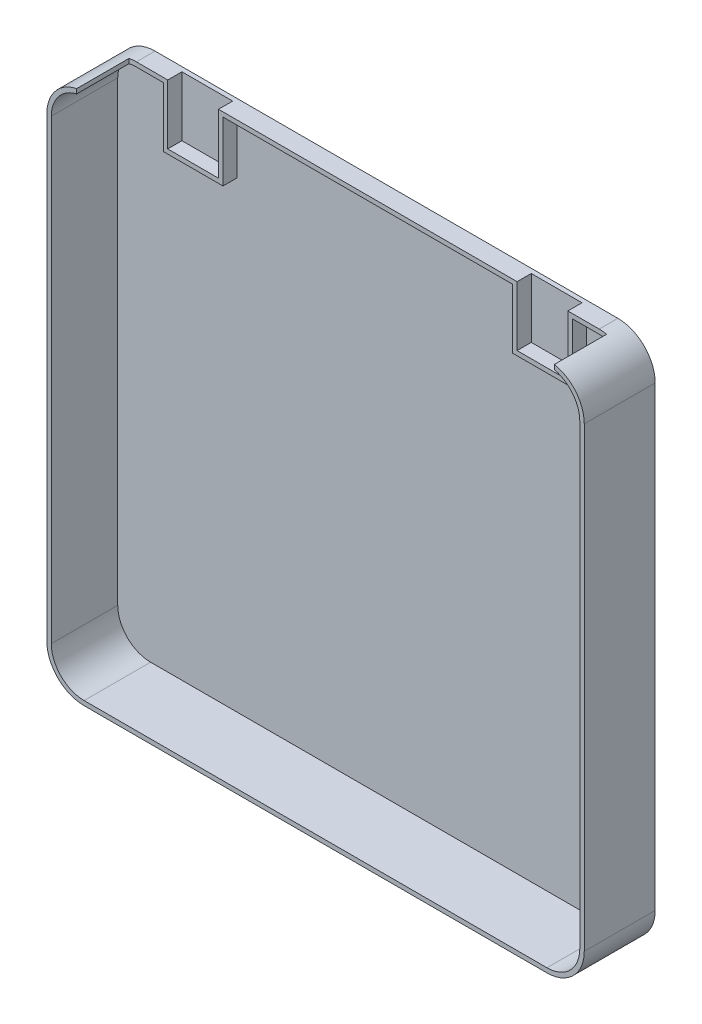
ISO-10303-21;
HEADER;
FILE_DESCRIPTION(('STEP AP214'),'2;1');
FILE_NAME('part.step','',(''),(''),'','','');
FILE_SCHEMA(('AUTOMOTIVE_DESIGN { 1 0 10303 214 1 1 1 1 }'));
ENDSEC;
DATA;
#1=APPLICATION_CONTEXT('core data for automotive mechanical design processes');
#2=APPLICATION_PROTOCOL_DEFINITION('international standard','automotive_design',2000,#1);
#3=PRODUCT_CONTEXT('',#1,'mechanical');
#4=PRODUCT('Part','Part','',(#3));
#5=PRODUCT_RELATED_PRODUCT_CATEGORY('part','',(#4));
#6=PRODUCT_DEFINITION_FORMATION('','',#4);
#7=PRODUCT_DEFINITION_CONTEXT('part definition',#1,'design');
#8=PRODUCT_DEFINITION('design','',#6,#7);
#9=PRODUCT_DEFINITION_SHAPE('','',#8);
#10=(LENGTH_UNIT() NAMED_UNIT(*) SI_UNIT(.MILLI.,.METRE.));
#11=(NAMED_UNIT(*) PLANE_ANGLE_UNIT() SI_UNIT($,.RADIAN.));
#12=(NAMED_UNIT(*) SI_UNIT($,.STERADIAN.) SOLID_ANGLE_UNIT());
#13=UNCERTAINTY_MEASURE_WITH_UNIT(LENGTH_MEASURE(1.E-05),#10,'distance_accuracy_value','');
#14=(GEOMETRIC_REPRESENTATION_CONTEXT(3) GLOBAL_UNCERTAINTY_ASSIGNED_CONTEXT((#13)) GLOBAL_UNIT_ASSIGNED_CONTEXT((#10,
#11,#12)) REPRESENTATION_CONTEXT('',''));
#15=CARTESIAN_POINT('',(0.,0.,0.));
#16=DIRECTION('',(0.,0.,1.));
#17=DIRECTION('',(1.,0.,0.));
#18=AXIS2_PLACEMENT_3D('',#15,#16,#17);
#19=CARTESIAN_POINT('',(335.,353.,3.));
#20=DIRECTION('',(0.,1.,0.));
#21=DIRECTION('',(0.,0.,1.));
#22=AXIS2_PLACEMENT_3D('',#19,#20,#21);
#23=PLANE('',#22);
#24=DIRECTION('',(0.,0.,-1.));
#25=VECTOR('',#24,1.);
#26=CARTESIAN_POINT('',(277.,353.,12.5));
#27=LINE('',#26,#25);
#28=CARTESIAN_POINT('',(277.,353.,12.5));
#29=VERTEX_POINT('',#28);
#30=CARTESIAN_POINT('',(277.,353.,3.));
#31=VERTEX_POINT('',#30);
#32=EDGE_CURVE('E444',#29,#31,#27,.T.);
#33=ORIENTED_EDGE('',*,*,#32,.F.);
#34=DIRECTION('',(1.,0.,0.));
#35=VECTOR('',#34,1.);
#36=CARTESIAN_POINT('',(335.,353.,12.5));
#37=LINE('',#36,#35);
#38=CARTESIAN_POINT('',(83.,353.,12.5));
#39=VERTEX_POINT('',#38);
#40=EDGE_CURVE('E512',#39,#29,#37,.T.);
#41=ORIENTED_EDGE('',*,*,#40,.F.);
#42=DIRECTION('',(0.,0.,-1.));
#43=VECTOR('',#42,1.);
#44=CARTESIAN_POINT('',(83.,353.,12.5));
#45=LINE('',#44,#43);
#46=CARTESIAN_POINT('',(83.,353.,3.));
#47=VERTEX_POINT('',#46);
#48=EDGE_CURVE('E353',#39,#47,#45,.T.);
#49=ORIENTED_EDGE('',*,*,#48,.T.);
#50=DIRECTION('',(-1.,0.,0.));
#51=VECTOR('',#50,1.);
#52=CARTESIAN_POINT('',(335.,353.,3.));
#53=LINE('',#52,#51);
#54=EDGE_CURVE('E560',#31,#47,#53,.T.);
#55=ORIENTED_EDGE('',*,*,#54,.F.);
#56=EDGE_LOOP('',(#33,#41,#49,#55));
#57=FACE_BOUND('',#56,.T.);
#58=ADVANCED_FACE('F86',(#57),#23,.F.);
#59=DIRECTION('',(0.,0.,-1.));
#60=VECTOR('',#59,1.);
#61=CARTESIAN_POINT('',(43.,353.,12.5));
#62=LINE('',#61,#60);
#63=CARTESIAN_POINT('',(43.,353.,12.5));
#64=VERTEX_POINT('',#63);
#65=CARTESIAN_POINT('',(43.,353.,3.));
#66=VERTEX_POINT('',#65);
#67=EDGE_CURVE('E358',#64,#66,#62,.T.);
#68=ORIENTED_EDGE('',*,*,#67,.F.);
#69=CARTESIAN_POINT('',(25.,353.,12.5));
#70=VERTEX_POINT('',#69);
#71=EDGE_CURVE('E515',#70,#64,#37,.T.);
#72=ORIENTED_EDGE('',*,*,#71,.F.);
#73=DIRECTION('',(0.,0.,1.));
#74=VECTOR('',#73,1.);
#75=CARTESIAN_POINT('',(25.,353.,3.));
#76=LINE('',#75,#74);
#77=CARTESIAN_POINT('',(25.,353.,3.));
#78=VERTEX_POINT('',#77);
#79=EDGE_CURVE('E579',#78,#70,#76,.T.);
#80=ORIENTED_EDGE('',*,*,#79,.F.);
#81=EDGE_CURVE('E556',#66,#78,#53,.T.);
#82=ORIENTED_EDGE('',*,*,#81,.F.);
#83=EDGE_LOOP('',(#68,#72,#80,#82));
#84=FACE_BOUND('',#83,.T.);
#85=ADVANCED_FACE('F483',(#84),#23,.F.);
#86=CARTESIAN_POINT('',(0.,356.,47.5));
#87=DIRECTION('',(0.,-1.,0.));
#88=DIRECTION('',(0.,0.,-1.));
#89=AXIS2_PLACEMENT_3D('',#86,#87,#88);
#90=PLANE('',#89);
#91=DIRECTION('',(1.,0.,0.));
#92=VECTOR('',#91,1.);
#93=CARTESIAN_POINT('',(20.,356.,12.5));
#94=LINE('',#93,#92);
#95=CARTESIAN_POINT('',(25.,356.,12.5));
#96=VERTEX_POINT('',#95);
#97=CARTESIAN_POINT('',(46.,356.,12.5));
#98=VERTEX_POINT('',#97);
#99=EDGE_CURVE('E322',#96,#98,#94,.T.);
#100=ORIENTED_EDGE('',*,*,#99,.T.);
#101=DIRECTION('',(0.,0.,1.));
#102=VECTOR('',#101,1.);
#103=CARTESIAN_POINT('',(46.,356.,12.5));
#104=LINE('',#103,#102);
#105=CARTESIAN_POINT('',(46.,356.,3.));
#106=VERTEX_POINT('',#105);
#107=EDGE_CURVE('E332',#106,#98,#104,.T.);
#108=ORIENTED_EDGE('',*,*,#107,.F.);
#109=DIRECTION('',(-1.,0.,0.));
#110=VECTOR('',#109,1.);
#111=CARTESIAN_POINT('',(46.,356.,3.));
#112=LINE('',#111,#110);
#113=CARTESIAN_POINT('',(80.,356.,3.));
#114=VERTEX_POINT('',#113);
#115=EDGE_CURVE('E457',#114,#106,#112,.T.);
#116=ORIENTED_EDGE('',*,*,#115,.F.);
#117=DIRECTION('',(0.,0.,-1.));
#118=VECTOR('',#117,1.);
#119=CARTESIAN_POINT('',(80.,356.,12.5));
#120=LINE('',#119,#118);
#121=CARTESIAN_POINT('',(80.,356.,12.5));
#122=VERTEX_POINT('',#121);
#123=EDGE_CURVE('E338',#122,#114,#120,.T.);
#124=ORIENTED_EDGE('',*,*,#123,.F.);
#125=CARTESIAN_POINT('',(280.,356.,12.5));
#126=VERTEX_POINT('',#125);
#127=EDGE_CURVE('E346',#122,#126,#94,.T.);
#128=ORIENTED_EDGE('',*,*,#127,.T.);
#129=DIRECTION('',(0.,0.,-1.));
#130=VECTOR('',#129,1.);
#131=CARTESIAN_POINT('',(280.,356.,12.5));
#132=LINE('',#131,#130);
#133=CARTESIAN_POINT('',(280.,356.,3.));
#134=VERTEX_POINT('',#133);
#135=EDGE_CURVE('E445',#126,#134,#132,.T.);
#136=ORIENTED_EDGE('',*,*,#135,.T.);
#137=DIRECTION('',(1.,0.,0.));
#138=VECTOR('',#137,1.);
#139=CARTESIAN_POINT('',(280.,356.,3.));
#140=LINE('',#139,#138);
#141=CARTESIAN_POINT('',(314.,356.,3.));
#142=VERTEX_POINT('',#141);
#143=EDGE_CURVE('E454',#134,#142,#140,.T.);
#144=ORIENTED_EDGE('',*,*,#143,.T.);
#145=DIRECTION('',(0.,0.,-1.));
#146=VECTOR('',#145,1.);
#147=CARTESIAN_POINT('',(314.,356.,12.5));
#148=LINE('',#147,#146);
#149=CARTESIAN_POINT('',(314.,356.,12.5));
#150=VERTEX_POINT('',#149);
#151=EDGE_CURVE('E452',#150,#142,#148,.T.);
#152=ORIENTED_EDGE('',*,*,#151,.F.);
#153=CARTESIAN_POINT('',(335.,356.,12.5));
#154=VERTEX_POINT('',#153);
#155=EDGE_CURVE('E348',#150,#154,#94,.T.);
#156=ORIENTED_EDGE('',*,*,#155,.T.);
#157=DIRECTION('',(0.,0.,-1.));
#158=VECTOR('',#157,1.);
#159=CARTESIAN_POINT('',(335.,356.,47.5));
#160=LINE('',#159,#158);
#161=CARTESIAN_POINT('',(335.,356.,0.));
#162=VERTEX_POINT('',#161);
#163=EDGE_CURVE('E648',#154,#162,#160,.T.);
#164=ORIENTED_EDGE('',*,*,#163,.T.);
#165=DIRECTION('',(-1.,0.,0.));
#166=VECTOR('',#165,1.);
#167=CARTESIAN_POINT('',(0.,356.,0.));
#168=LINE('',#167,#166);
#169=CARTESIAN_POINT('',(25.,356.,0.));
#170=VERTEX_POINT('',#169);
#171=EDGE_CURVE('E600',#162,#170,#168,.T.);
#172=ORIENTED_EDGE('',*,*,#171,.T.);
#173=DIRECTION('',(0.,0.,-1.));
#174=VECTOR('',#173,1.);
#175=CARTESIAN_POINT('',(25.,356.,47.5));
#176=LINE('',#175,#174);
#177=EDGE_CURVE('E344',#170,#96,#176,.F.);
#178=ORIENTED_EDGE('',*,*,#177,.T.);
#179=EDGE_LOOP('',(#100,#108,#116,#124,#128,#136,#144,#152,#156,#164,#172,#178));
#180=FACE_BOUND('',#179,.T.);
#181=ADVANCED_FACE('F341',(#180),#90,.F.);
#182=CARTESIAN_POINT('',(335.,331.,47.5));
#183=DIRECTION('',(0.,0.,-1.));
#184=DIRECTION('',(-1.,0.,0.));
#185=AXIS2_PLACEMENT_3D('',#182,#183,#184);
#186=CYLINDRICAL_SURFACE('',#185,25.);
#187=ORIENTED_EDGE('',*,*,#163,.F.);
#188=CARTESIAN_POINT('',(335.,331.,12.5));
#189=DIRECTION('',(0.,0.,1.));
#190=DIRECTION('',(1.,0.,0.));
#191=AXIS2_PLACEMENT_3D('',#188,#189,#190);
#192=CIRCLE('',#191,25.);
#193=CARTESIAN_POINT('',(340.,355.494897427832,12.5));
#194=VERTEX_POINT('',#193);
#195=EDGE_CURVE('E525',#154,#194,#192,.F.);
#196=ORIENTED_EDGE('',*,*,#195,.T.);
#197=DIRECTION('',(0.,0.,-1.));
#198=VECTOR('',#197,1.);
#199=CARTESIAN_POINT('',(340.,355.494897427832,47.5));
#200=LINE('',#199,#198);
#201=CARTESIAN_POINT('',(340.,355.494897427832,47.5));
#202=VERTEX_POINT('',#201);
#203=EDGE_CURVE('E513',#202,#194,#200,.T.);
#204=ORIENTED_EDGE('',*,*,#203,.F.);
#205=CARTESIAN_POINT('',(335.,331.,47.5));
#206=DIRECTION('',(0.,0.,-1.));
#207=DIRECTION('',(-1.,0.,0.));
#208=AXIS2_PLACEMENT_3D('',#205,#206,#207);
#209=CIRCLE('',#208,25.);
#210=CARTESIAN_POINT('',(360.,331.,47.5));
#211=VERTEX_POINT('',#210);
#212=EDGE_CURVE('E635',#211,#202,#209,.F.);
#213=ORIENTED_EDGE('',*,*,#212,.F.);
#214=DIRECTION('',(0.,0.,-1.));
#215=VECTOR('',#214,1.);
#216=CARTESIAN_POINT('',(360.,331.,47.5));
#217=LINE('',#216,#215);
#218=CARTESIAN_POINT('',(360.,331.,0.));
#219=VERTEX_POINT('',#218);
#220=EDGE_CURVE('E642',#219,#211,#217,.F.);
#221=ORIENTED_EDGE('',*,*,#220,.F.);
#222=CARTESIAN_POINT('',(335.,331.,0.));
#223=DIRECTION('',(0.,0.,-1.));
#224=DIRECTION('',(-1.,0.,0.));
#225=AXIS2_PLACEMENT_3D('',#222,#223,#224);
#226=CIRCLE('',#225,25.);
#227=EDGE_CURVE('E622',#162,#219,#226,.T.);
#228=ORIENTED_EDGE('',*,*,#227,.F.);
#229=EDGE_LOOP('',(#187,#196,#204,#213,#221,#228));
#230=FACE_BOUND('',#229,.T.);
#231=ADVANCED_FACE('F702',(#230),#186,.T.);
#232=CARTESIAN_POINT('',(25.,331.,47.5));
#233=DIRECTION('',(0.,0.,-1.));
#234=DIRECTION('',(-1.,0.,0.));
#235=AXIS2_PLACEMENT_3D('',#232,#233,#234);
#236=CYLINDRICAL_SURFACE('',#235,25.);
#237=DIRECTION('',(0.,0.,-1.));
#238=VECTOR('',#237,1.);
#239=CARTESIAN_POINT('',(20.,355.494897427832,47.5));
#240=LINE('',#239,#238);
#241=CARTESIAN_POINT('',(20.,355.494897427832,47.5));
#242=VERTEX_POINT('',#241);
#243=CARTESIAN_POINT('',(20.,355.494897427832,12.5));
#244=VERTEX_POINT('',#243);
#245=EDGE_CURVE('E530',#242,#244,#240,.T.);
#246=ORIENTED_EDGE('',*,*,#245,.T.);
#247=CARTESIAN_POINT('',(25.,331.,12.5));
#248=DIRECTION('',(0.,0.,1.));
#249=DIRECTION('',(1.,0.,0.));
#250=AXIS2_PLACEMENT_3D('',#247,#248,#249);
#251=CIRCLE('',#250,25.);
#252=EDGE_CURVE('E522',#244,#96,#251,.F.);
#253=ORIENTED_EDGE('',*,*,#252,.T.);
#254=ORIENTED_EDGE('',*,*,#177,.F.);
#255=CARTESIAN_POINT('',(25.,331.,0.));
#256=DIRECTION('',(0.,0.,-1.));
#257=DIRECTION('',(-1.,0.,0.));
#258=AXIS2_PLACEMENT_3D('',#255,#256,#257);
#259=CIRCLE('',#258,25.);
#260=CARTESIAN_POINT('',(0.,331.,0.));
#261=VERTEX_POINT('',#260);
#262=EDGE_CURVE('E620',#261,#170,#259,.T.);
#263=ORIENTED_EDGE('',*,*,#262,.F.);
#264=DIRECTION('',(0.,0.,-1.));
#265=VECTOR('',#264,1.);
#266=CARTESIAN_POINT('',(0.,331.,47.5));
#267=LINE('',#266,#265);
#268=CARTESIAN_POINT('',(0.,331.,47.5));
#269=VERTEX_POINT('',#268);
#270=EDGE_CURVE('E628',#269,#261,#267,.T.);
#271=ORIENTED_EDGE('',*,*,#270,.F.);
#272=CARTESIAN_POINT('',(25.,331.,47.5));
#273=DIRECTION('',(0.,0.,-1.));
#274=DIRECTION('',(-1.,0.,0.));
#275=AXIS2_PLACEMENT_3D('',#272,#273,#274);
#276=CIRCLE('',#275,25.);
#277=EDGE_CURVE('E633',#242,#269,#276,.F.);
#278=ORIENTED_EDGE('',*,*,#277,.F.);
#279=EDGE_LOOP('',(#246,#253,#254,#263,#271,#278));
#280=FACE_BOUND('',#279,.T.);
#281=ADVANCED_FACE('F88',(#280),#236,.T.);
#282=CARTESIAN_POINT('',(25.,331.,3.));
#283=DIRECTION('',(0.,0.,1.));
#284=DIRECTION('',(1.,0.,0.));
#285=AXIS2_PLACEMENT_3D('',#282,#283,#284);
#286=CYLINDRICAL_SURFACE('',#285,22.);
#287=CARTESIAN_POINT('',(25.,331.,12.5));
#288=DIRECTION('',(0.,0.,1.));
#289=DIRECTION('',(1.,0.,0.));
#290=AXIS2_PLACEMENT_3D('',#287,#288,#289);
#291=CIRCLE('',#290,22.);
#292=CARTESIAN_POINT('',(20.,352.424285285629,12.5));
#293=VERTEX_POINT('',#292);
#294=EDGE_CURVE('E520',#293,#70,#291,.F.);
#295=ORIENTED_EDGE('',*,*,#294,.F.);
#296=DIRECTION('',(0.,0.,1.));
#297=VECTOR('',#296,1.);
#298=CARTESIAN_POINT('',(20.,352.424285285629,3.));
#299=LINE('',#298,#297);
#300=CARTESIAN_POINT('',(20.,352.424285285629,47.5));
#301=VERTEX_POINT('',#300);
#302=EDGE_CURVE('E12',#301,#293,#299,.F.);
#303=ORIENTED_EDGE('',*,*,#302,.F.);
#304=CARTESIAN_POINT('',(25.,331.,47.5));
#305=DIRECTION('',(0.,0.,1.));
#306=DIRECTION('',(1.,0.,0.));
#307=AXIS2_PLACEMENT_3D('',#304,#305,#306);
#308=CIRCLE('',#307,22.);
#309=CARTESIAN_POINT('',(3.,331.,47.5));
#310=VERTEX_POINT('',#309);
#311=EDGE_CURVE('E533',#301,#310,#308,.T.);
#312=ORIENTED_EDGE('',*,*,#311,.T.);
#313=DIRECTION('',(0.,0.,1.));
#314=VECTOR('',#313,1.);
#315=CARTESIAN_POINT('',(3.,331.,3.));
#316=LINE('',#315,#314);
#317=CARTESIAN_POINT('',(3.,331.,3.));
#318=VERTEX_POINT('',#317);
#319=EDGE_CURVE('E559',#318,#310,#316,.T.);
#320=ORIENTED_EDGE('',*,*,#319,.F.);
#321=CARTESIAN_POINT('',(25.,331.,3.));
#322=DIRECTION('',(0.,0.,1.));
#323=DIRECTION('',(1.,0.,0.));
#324=AXIS2_PLACEMENT_3D('',#321,#322,#323);
#325=CIRCLE('',#324,22.);
#326=EDGE_CURVE('E534',#78,#318,#325,.T.);
#327=ORIENTED_EDGE('',*,*,#326,.F.);
#328=ORIENTED_EDGE('',*,*,#79,.T.);
#329=EDGE_LOOP('',(#295,#303,#312,#320,#327,#328));
#330=FACE_BOUND('',#329,.T.);
#331=ADVANCED_FACE('F494',(#330),#286,.F.);
#332=CARTESIAN_POINT('',(317.,353.,12.5));
#333=VERTEX_POINT('',#332);
#334=CARTESIAN_POINT('',(335.,353.,12.5));
#335=VERTEX_POINT('',#334);
#336=EDGE_CURVE('E506',#333,#335,#37,.T.);
#337=ORIENTED_EDGE('',*,*,#336,.F.);
#338=DIRECTION('',(0.,0.,-1.));
#339=VECTOR('',#338,1.);
#340=CARTESIAN_POINT('',(317.,353.,12.5));
#341=LINE('',#340,#339);
#342=CARTESIAN_POINT('',(317.,353.,3.));
#343=VERTEX_POINT('',#342);
#344=EDGE_CURVE('E441',#333,#343,#341,.T.);
#345=ORIENTED_EDGE('',*,*,#344,.T.);
#346=CARTESIAN_POINT('',(335.,353.,3.));
#347=VERTEX_POINT('',#346);
#348=EDGE_CURVE('E557',#347,#343,#53,.T.);
#349=ORIENTED_EDGE('',*,*,#348,.F.);
#350=DIRECTION('',(0.,0.,1.));
#351=VECTOR('',#350,1.);
#352=CARTESIAN_POINT('',(335.,353.,3.));
#353=LINE('',#352,#351);
#354=EDGE_CURVE('E509',#347,#335,#353,.T.);
#355=ORIENTED_EDGE('',*,*,#354,.T.);
#356=EDGE_LOOP('',(#337,#345,#349,#355));
#357=FACE_BOUND('',#356,.T.);
#358=ADVANCED_FACE('F485',(#357),#23,.F.);
#359=CARTESIAN_POINT('',(335.,331.,3.));
#360=DIRECTION('',(0.,0.,1.));
#361=DIRECTION('',(1.,0.,0.));
#362=AXIS2_PLACEMENT_3D('',#359,#360,#361);
#363=CYLINDRICAL_SURFACE('',#362,22.);
#364=CARTESIAN_POINT('',(335.,331.,12.5));
#365=DIRECTION('',(0.,0.,1.));
#366=DIRECTION('',(1.,0.,0.));
#367=AXIS2_PLACEMENT_3D('',#364,#365,#366);
#368=CIRCLE('',#367,22.);
#369=CARTESIAN_POINT('',(340.,352.424285285629,12.5));
#370=VERTEX_POINT('',#369);
#371=EDGE_CURVE('E94',#335,#370,#368,.F.);
#372=ORIENTED_EDGE('',*,*,#371,.F.);
#373=ORIENTED_EDGE('',*,*,#354,.F.);
#374=CARTESIAN_POINT('',(335.,331.,3.));
#375=DIRECTION('',(0.,0.,1.));
#376=DIRECTION('',(1.,0.,0.));
#377=AXIS2_PLACEMENT_3D('',#374,#375,#376);
#378=CIRCLE('',#377,22.);
#379=CARTESIAN_POINT('',(357.,331.,3.));
#380=VERTEX_POINT('',#379);
#381=EDGE_CURVE('E553',#380,#347,#378,.T.);
#382=ORIENTED_EDGE('',*,*,#381,.F.);
#383=DIRECTION('',(0.,0.,1.));
#384=VECTOR('',#383,1.);
#385=CARTESIAN_POINT('',(357.,331.,3.));
#386=LINE('',#385,#384);
#387=CARTESIAN_POINT('',(357.,331.,47.5));
#388=VERTEX_POINT('',#387);
#389=EDGE_CURVE('E584',#380,#388,#386,.T.);
#390=ORIENTED_EDGE('',*,*,#389,.T.);
#391=CARTESIAN_POINT('',(335.,331.,47.5));
#392=DIRECTION('',(0.,0.,1.));
#393=DIRECTION('',(1.,0.,0.));
#394=AXIS2_PLACEMENT_3D('',#391,#392,#393);
#395=CIRCLE('',#394,22.);
#396=CARTESIAN_POINT('',(340.,352.424285285629,47.5));
#397=VERTEX_POINT('',#396);
#398=EDGE_CURVE('E538',#388,#397,#395,.T.);
#399=ORIENTED_EDGE('',*,*,#398,.T.);
#400=DIRECTION('',(0.,0.,1.));
#401=VECTOR('',#400,1.);
#402=CARTESIAN_POINT('',(340.,352.424285285629,3.));
#403=LINE('',#402,#401);
#404=EDGE_CURVE('E650',#397,#370,#403,.F.);
#405=ORIENTED_EDGE('',*,*,#404,.T.);
#406=EDGE_LOOP('',(#372,#373,#382,#390,#399,#405));
#407=FACE_BOUND('',#406,.T.);
#408=ADVANCED_FACE('F493',(#407),#363,.F.);
#409=CARTESIAN_POINT('',(0.,0.,47.5));
#410=DIRECTION('',(1.,0.,0.));
#411=DIRECTION('',(0.,0.,-1.));
#412=AXIS2_PLACEMENT_3D('',#409,#410,#411);
#413=PLANE('',#412);
#414=DIRECTION('',(0.,-1.,0.));
#415=VECTOR('',#414,1.);
#416=CARTESIAN_POINT('',(0.,0.,0.));
#417=LINE('',#416,#415);
#418=CARTESIAN_POINT('',(0.,25.,0.));
#419=VERTEX_POINT('',#418);
#420=EDGE_CURVE('E582',#261,#419,#417,.T.);
#421=ORIENTED_EDGE('',*,*,#420,.T.);
#422=DIRECTION('',(0.,0.,-1.));
#423=VECTOR('',#422,1.);
#424=CARTESIAN_POINT('',(0.,25.,47.5));
#425=LINE('',#424,#423);
#426=CARTESIAN_POINT('',(0.,25.,47.5));
#427=VERTEX_POINT('',#426);
#428=EDGE_CURVE('E631',#419,#427,#425,.F.);
#429=ORIENTED_EDGE('',*,*,#428,.T.);
#430=DIRECTION('',(0.,-1.,0.));
#431=VECTOR('',#430,1.);
#432=CARTESIAN_POINT('',(0.,0.,47.5));
#433=LINE('',#432,#431);
#434=EDGE_CURVE('E596',#269,#427,#433,.T.);
#435=ORIENTED_EDGE('',*,*,#434,.F.);
#436=ORIENTED_EDGE('',*,*,#270,.T.);
#437=EDGE_LOOP('',(#421,#429,#435,#436));
#438=FACE_BOUND('',#437,.T.);
#439=ADVANCED_FACE('F500',(#438),#413,.F.);
#440=CARTESIAN_POINT('',(0.,0.,47.5));
#441=DIRECTION('',(0.,1.,0.));
#442=DIRECTION('',(0.,0.,1.));
#443=AXIS2_PLACEMENT_3D('',#440,#441,#442);
#444=PLANE('',#443);
#445=DIRECTION('',(1.,0.,0.));
#446=VECTOR('',#445,1.);
#447=CARTESIAN_POINT('',(0.,0.,47.5));
#448=LINE('',#447,#446);
#449=CARTESIAN_POINT('',(25.,0.,47.5));
#450=VERTEX_POINT('',#449);
#451=CARTESIAN_POINT('',(335.,0.,47.5));
#452=VERTEX_POINT('',#451);
#453=EDGE_CURVE('E599',#450,#452,#448,.T.);
#454=ORIENTED_EDGE('',*,*,#453,.F.);
#455=DIRECTION('',(0.,0.,-1.));
#456=VECTOR('',#455,1.);
#457=CARTESIAN_POINT('',(25.,0.,47.5));
#458=LINE('',#457,#456);
#459=CARTESIAN_POINT('',(25.,0.,0.));
#460=VERTEX_POINT('',#459);
#461=EDGE_CURVE('E617',#450,#460,#458,.T.);
#462=ORIENTED_EDGE('',*,*,#461,.T.);
#463=DIRECTION('',(1.,0.,0.));
#464=VECTOR('',#463,1.);
#465=CARTESIAN_POINT('',(0.,0.,0.));
#466=LINE('',#465,#464);
#467=CARTESIAN_POINT('',(335.,0.,0.));
#468=VERTEX_POINT('',#467);
#469=EDGE_CURVE('E609',#460,#468,#466,.T.);
#470=ORIENTED_EDGE('',*,*,#469,.T.);
#471=DIRECTION('',(0.,0.,-1.));
#472=VECTOR('',#471,1.);
#473=CARTESIAN_POINT('',(335.,0.,47.5));
#474=LINE('',#473,#472);
#475=EDGE_CURVE('E606',#468,#452,#474,.F.);
#476=ORIENTED_EDGE('',*,*,#475,.T.);
#477=EDGE_LOOP('',(#454,#462,#470,#476));
#478=FACE_BOUND('',#477,.T.);
#479=ADVANCED_FACE('F688',(#478),#444,.F.);
#480=CARTESIAN_POINT('',(360.,0.,47.5));
#481=DIRECTION('',(-1.,0.,0.));
#482=DIRECTION('',(0.,0.,1.));
#483=AXIS2_PLACEMENT_3D('',#480,#481,#482);
#484=PLANE('',#483);
#485=DIRECTION('',(0.,1.,0.));
#486=VECTOR('',#485,1.);
#487=CARTESIAN_POINT('',(360.,0.,47.5));
#488=LINE('',#487,#486);
#489=CARTESIAN_POINT('',(360.,25.,47.5));
#490=VERTEX_POINT('',#489);
#491=EDGE_CURVE('E603',#490,#211,#488,.T.);
#492=ORIENTED_EDGE('',*,*,#491,.F.);
#493=DIRECTION('',(0.,0.,-1.));
#494=VECTOR('',#493,1.);
#495=CARTESIAN_POINT('',(360.,25.,47.5));
#496=LINE('',#495,#494);
#497=CARTESIAN_POINT('',(360.,25.,0.));
#498=VERTEX_POINT('',#497);
#499=EDGE_CURVE('E644',#490,#498,#496,.T.);
#500=ORIENTED_EDGE('',*,*,#499,.T.);
#501=DIRECTION('',(0.,1.,0.));
#502=VECTOR('',#501,1.);
#503=CARTESIAN_POINT('',(360.,0.,0.));
#504=LINE('',#503,#502);
#505=EDGE_CURVE('E612',#498,#219,#504,.T.);
#506=ORIENTED_EDGE('',*,*,#505,.T.);
#507=ORIENTED_EDGE('',*,*,#220,.T.);
#508=EDGE_LOOP('',(#492,#500,#506,#507));
#509=FACE_BOUND('',#508,.T.);
#510=ADVANCED_FACE('F697',(#509),#484,.F.);
#511=CARTESIAN_POINT('',(0.,0.,47.5));
#512=DIRECTION('',(0.,0.,-1.));
#513=DIRECTION('',(-1.,0.,0.));
#514=AXIS2_PLACEMENT_3D('',#511,#512,#513);
#515=PLANE('',#514);
#516=ORIENTED_EDGE('',*,*,#212,.T.);
#517=DIRECTION('',(0.,1.,0.));
#518=VECTOR('',#517,1.);
#519=CARTESIAN_POINT('',(340.,346.,47.5));
#520=LINE('',#519,#518);
#521=EDGE_CURVE('E657',#397,#202,#520,.T.);
#522=ORIENTED_EDGE('',*,*,#521,.F.);
#523=ORIENTED_EDGE('',*,*,#398,.F.);
#524=DIRECTION('',(0.,1.,0.));
#525=VECTOR('',#524,1.);
#526=CARTESIAN_POINT('',(357.,25.,47.5));
#527=LINE('',#526,#525);
#528=CARTESIAN_POINT('',(357.,25.,47.5));
#529=VERTEX_POINT('',#528);
#530=EDGE_CURVE('E574',#529,#388,#527,.T.);
#531=ORIENTED_EDGE('',*,*,#530,.F.);
#532=CARTESIAN_POINT('',(335.,25.,47.5));
#533=DIRECTION('',(0.,0.,1.));
#534=DIRECTION('',(1.,0.,0.));
#535=AXIS2_PLACEMENT_3D('',#532,#533,#534);
#536=CIRCLE('',#535,22.);
#537=CARTESIAN_POINT('',(335.,3.,47.5));
#538=VERTEX_POINT('',#537);
#539=EDGE_CURVE('E571',#538,#529,#536,.T.);
#540=ORIENTED_EDGE('',*,*,#539,.F.);
#541=DIRECTION('',(1.,0.,0.));
#542=VECTOR('',#541,1.);
#543=CARTESIAN_POINT('',(25.,3.,47.5));
#544=LINE('',#543,#542);
#545=CARTESIAN_POINT('',(25.,3.,47.5));
#546=VERTEX_POINT('',#545);
#547=EDGE_CURVE('E568',#546,#538,#544,.T.);
#548=ORIENTED_EDGE('',*,*,#547,.F.);
#549=CARTESIAN_POINT('',(25.,25.,47.5));
#550=DIRECTION('',(0.,0.,1.));
#551=DIRECTION('',(1.,0.,0.));
#552=AXIS2_PLACEMENT_3D('',#549,#550,#551);
#553=CIRCLE('',#552,22.);
#554=CARTESIAN_POINT('',(3.,25.,47.5));
#555=VERTEX_POINT('',#554);
#556=EDGE_CURVE('E565',#555,#546,#553,.T.);
#557=ORIENTED_EDGE('',*,*,#556,.F.);
#558=DIRECTION('',(0.,-1.,0.));
#559=VECTOR('',#558,1.);
#560=CARTESIAN_POINT('',(3.,331.,47.5));
#561=LINE('',#560,#559);
#562=EDGE_CURVE('E562',#310,#555,#561,.T.);
#563=ORIENTED_EDGE('',*,*,#562,.F.);
#564=ORIENTED_EDGE('',*,*,#311,.F.);
#565=DIRECTION('',(0.,1.,0.));
#566=VECTOR('',#565,1.);
#567=CARTESIAN_POINT('',(20.,346.,47.5));
#568=LINE('',#567,#566);
#569=EDGE_CURVE('E350',#301,#242,#568,.T.);
#570=ORIENTED_EDGE('',*,*,#569,.T.);
#571=ORIENTED_EDGE('',*,*,#277,.T.);
#572=ORIENTED_EDGE('',*,*,#434,.T.);
#573=CARTESIAN_POINT('',(25.,25.,47.5));
#574=DIRECTION('',(0.,0.,-1.));
#575=DIRECTION('',(-1.,0.,0.));
#576=AXIS2_PLACEMENT_3D('',#573,#574,#575);
#577=CIRCLE('',#576,25.);
#578=EDGE_CURVE('E640',#427,#450,#577,.F.);
#579=ORIENTED_EDGE('',*,*,#578,.T.);
#580=ORIENTED_EDGE('',*,*,#453,.T.);
#581=CARTESIAN_POINT('',(335.,25.,47.5));
#582=DIRECTION('',(0.,0.,-1.));
#583=DIRECTION('',(-1.,0.,0.));
#584=AXIS2_PLACEMENT_3D('',#581,#582,#583);
#585=CIRCLE('',#584,25.);
#586=EDGE_CURVE('E638',#452,#490,#585,.F.);
#587=ORIENTED_EDGE('',*,*,#586,.T.);
#588=ORIENTED_EDGE('',*,*,#491,.T.);
#589=EDGE_LOOP('',(#516,#522,#523,#531,#540,#548,#557,#563,#564,#570,#571,#572,#579,#580,#587,#588));
#590=FACE_BOUND('',#589,.T.);
#591=ADVANCED_FACE('F660',(#590),#515,.F.);
#592=CARTESIAN_POINT('',(0.,0.,0.));
#593=DIRECTION('',(0.,0.,-1.));
#594=DIRECTION('',(-1.,0.,0.));
#595=AXIS2_PLACEMENT_3D('',#592,#593,#594);
#596=PLANE('',#595);
#597=ORIENTED_EDGE('',*,*,#469,.F.);
#598=CARTESIAN_POINT('',(25.,25.,0.));
#599=DIRECTION('',(0.,0.,-1.));
#600=DIRECTION('',(-1.,0.,0.));
#601=AXIS2_PLACEMENT_3D('',#598,#599,#600);
#602=CIRCLE('',#601,25.);
#603=EDGE_CURVE('E626',#460,#419,#602,.T.);
#604=ORIENTED_EDGE('',*,*,#603,.T.);
#605=ORIENTED_EDGE('',*,*,#420,.F.);
#606=ORIENTED_EDGE('',*,*,#262,.T.);
#607=ORIENTED_EDGE('',*,*,#171,.F.);
#608=ORIENTED_EDGE('',*,*,#227,.T.);
#609=ORIENTED_EDGE('',*,*,#505,.F.);
#610=CARTESIAN_POINT('',(335.,25.,0.));
#611=DIRECTION('',(0.,0.,-1.));
#612=DIRECTION('',(-1.,0.,0.));
#613=AXIS2_PLACEMENT_3D('',#610,#611,#612);
#614=CIRCLE('',#613,25.);
#615=EDGE_CURVE('E624',#498,#468,#614,.T.);
#616=ORIENTED_EDGE('',*,*,#615,.T.);
#617=EDGE_LOOP('',(#597,#604,#605,#606,#607,#608,#609,#616));
#618=FACE_BOUND('',#617,.T.);
#619=ADVANCED_FACE('F680',(#618),#596,.T.);
#620=CARTESIAN_POINT('',(25.,25.,47.5));
#621=DIRECTION('',(0.,0.,-1.));
#622=DIRECTION('',(-1.,0.,0.));
#623=AXIS2_PLACEMENT_3D('',#620,#621,#622);
#624=CYLINDRICAL_SURFACE('',#623,25.);
#625=ORIENTED_EDGE('',*,*,#578,.F.);
#626=ORIENTED_EDGE('',*,*,#428,.F.);
#627=ORIENTED_EDGE('',*,*,#603,.F.);
#628=ORIENTED_EDGE('',*,*,#461,.F.);
#629=EDGE_LOOP('',(#625,#626,#627,#628));
#630=FACE_BOUND('',#629,.T.);
#631=ADVANCED_FACE('F685',(#630),#624,.T.);
#632=CARTESIAN_POINT('',(335.,25.,47.5));
#633=DIRECTION('',(0.,0.,-1.));
#634=DIRECTION('',(-1.,0.,0.));
#635=AXIS2_PLACEMENT_3D('',#632,#633,#634);
#636=CYLINDRICAL_SURFACE('',#635,25.);
#637=ORIENTED_EDGE('',*,*,#586,.F.);
#638=ORIENTED_EDGE('',*,*,#475,.F.);
#639=ORIENTED_EDGE('',*,*,#615,.F.);
#640=ORIENTED_EDGE('',*,*,#499,.F.);
#641=EDGE_LOOP('',(#637,#638,#639,#640));
#642=FACE_BOUND('',#641,.T.);
#643=ADVANCED_FACE('F694',(#642),#636,.T.);
#644=CARTESIAN_POINT('',(357.,25.,3.));
#645=DIRECTION('',(1.,0.,0.));
#646=DIRECTION('',(0.,0.,-1.));
#647=AXIS2_PLACEMENT_3D('',#644,#645,#646);
#648=PLANE('',#647);
#649=ORIENTED_EDGE('',*,*,#530,.T.);
#650=ORIENTED_EDGE('',*,*,#389,.F.);
#651=DIRECTION('',(0.,1.,0.));
#652=VECTOR('',#651,1.);
#653=CARTESIAN_POINT('',(357.,25.,3.));
#654=LINE('',#653,#652);
#655=CARTESIAN_POINT('',(357.,25.,3.));
#656=VERTEX_POINT('',#655);
#657=EDGE_CURVE('E550',#656,#380,#654,.T.);
#658=ORIENTED_EDGE('',*,*,#657,.F.);
#659=DIRECTION('',(0.,0.,1.));
#660=VECTOR('',#659,1.);
#661=CARTESIAN_POINT('',(357.,25.,3.));
#662=LINE('',#661,#660);
#663=EDGE_CURVE('E586',#656,#529,#662,.T.);
#664=ORIENTED_EDGE('',*,*,#663,.T.);
#665=EDGE_LOOP('',(#649,#650,#658,#664));
#666=FACE_BOUND('',#665,.T.);
#667=ADVANCED_FACE('F760',(#666),#648,.F.);
#668=CARTESIAN_POINT('',(335.,25.,3.));
#669=DIRECTION('',(0.,0.,1.));
#670=DIRECTION('',(1.,0.,0.));
#671=AXIS2_PLACEMENT_3D('',#668,#669,#670);
#672=CYLINDRICAL_SURFACE('',#671,22.);
#673=ORIENTED_EDGE('',*,*,#539,.T.);
#674=ORIENTED_EDGE('',*,*,#663,.F.);
#675=CARTESIAN_POINT('',(335.,25.,3.));
#676=DIRECTION('',(0.,0.,1.));
#677=DIRECTION('',(1.,0.,0.));
#678=AXIS2_PLACEMENT_3D('',#675,#676,#677);
#679=CIRCLE('',#678,22.);
#680=CARTESIAN_POINT('',(335.,3.,3.));
#681=VERTEX_POINT('',#680);
#682=EDGE_CURVE('E547',#681,#656,#679,.T.);
#683=ORIENTED_EDGE('',*,*,#682,.F.);
#684=DIRECTION('',(0.,0.,1.));
#685=VECTOR('',#684,1.);
#686=CARTESIAN_POINT('',(335.,3.,3.));
#687=LINE('',#686,#685);
#688=EDGE_CURVE('E588',#681,#538,#687,.T.);
#689=ORIENTED_EDGE('',*,*,#688,.T.);
#690=EDGE_LOOP('',(#673,#674,#683,#689));
#691=FACE_BOUND('',#690,.T.);
#692=ADVANCED_FACE('F756',(#691),#672,.F.);
#693=CARTESIAN_POINT('',(25.,3.,3.));
#694=DIRECTION('',(0.,-1.,0.));
#695=DIRECTION('',(1.,0.,0.));
#696=AXIS2_PLACEMENT_3D('',#693,#694,#695);
#697=PLANE('',#696);
#698=ORIENTED_EDGE('',*,*,#547,.T.);
#699=ORIENTED_EDGE('',*,*,#688,.F.);
#700=DIRECTION('',(1.,0.,0.));
#701=VECTOR('',#700,1.);
#702=CARTESIAN_POINT('',(25.,3.,3.));
#703=LINE('',#702,#701);
#704=CARTESIAN_POINT('',(25.,3.,3.));
#705=VERTEX_POINT('',#704);
#706=EDGE_CURVE('E544',#705,#681,#703,.T.);
#707=ORIENTED_EDGE('',*,*,#706,.F.);
#708=DIRECTION('',(0.,0.,1.));
#709=VECTOR('',#708,1.);
#710=CARTESIAN_POINT('',(25.,3.,3.));
#711=LINE('',#710,#709);
#712=EDGE_CURVE('E590',#705,#546,#711,.T.);
#713=ORIENTED_EDGE('',*,*,#712,.T.);
#714=EDGE_LOOP('',(#698,#699,#707,#713));
#715=FACE_BOUND('',#714,.T.);
#716=ADVANCED_FACE('F752',(#715),#697,.F.);
#717=CARTESIAN_POINT('',(25.,25.,3.));
#718=DIRECTION('',(0.,0.,1.));
#719=DIRECTION('',(1.,0.,0.));
#720=AXIS2_PLACEMENT_3D('',#717,#718,#719);
#721=CYLINDRICAL_SURFACE('',#720,22.);
#722=ORIENTED_EDGE('',*,*,#556,.T.);
#723=ORIENTED_EDGE('',*,*,#712,.F.);
#724=CARTESIAN_POINT('',(25.,25.,3.));
#725=DIRECTION('',(0.,0.,1.));
#726=DIRECTION('',(1.,0.,0.));
#727=AXIS2_PLACEMENT_3D('',#724,#725,#726);
#728=CIRCLE('',#727,22.);
#729=CARTESIAN_POINT('',(3.,25.,3.));
#730=VERTEX_POINT('',#729);
#731=EDGE_CURVE('E541',#730,#705,#728,.T.);
#732=ORIENTED_EDGE('',*,*,#731,.F.);
#733=DIRECTION('',(0.,0.,1.));
#734=VECTOR('',#733,1.);
#735=CARTESIAN_POINT('',(3.,25.,3.));
#736=LINE('',#735,#734);
#737=EDGE_CURVE('E592',#730,#555,#736,.T.);
#738=ORIENTED_EDGE('',*,*,#737,.T.);
#739=EDGE_LOOP('',(#722,#723,#732,#738));
#740=FACE_BOUND('',#739,.T.);
#741=ADVANCED_FACE('F730',(#740),#721,.F.);
#742=CARTESIAN_POINT('',(3.,331.,3.));
#743=DIRECTION('',(-1.,0.,0.));
#744=DIRECTION('',(0.,0.,1.));
#745=AXIS2_PLACEMENT_3D('',#742,#743,#744);
#746=PLANE('',#745);
#747=ORIENTED_EDGE('',*,*,#562,.T.);
#748=ORIENTED_EDGE('',*,*,#737,.F.);
#749=DIRECTION('',(0.,-1.,0.));
#750=VECTOR('',#749,1.);
#751=CARTESIAN_POINT('',(3.,331.,3.));
#752=LINE('',#751,#750);
#753=EDGE_CURVE('E537',#318,#730,#752,.T.);
#754=ORIENTED_EDGE('',*,*,#753,.F.);
#755=ORIENTED_EDGE('',*,*,#319,.T.);
#756=EDGE_LOOP('',(#747,#748,#754,#755));
#757=FACE_BOUND('',#756,.T.);
#758=ADVANCED_FACE('F723',(#757),#746,.F.);
#759=CARTESIAN_POINT('',(25.,331.,3.));
#760=DIRECTION('',(0.,0.,1.));
#761=DIRECTION('',(1.,0.,0.));
#762=AXIS2_PLACEMENT_3D('',#759,#760,#761);
#763=PLANE('',#762);
#764=DIRECTION('',(0.,-1.,0.));
#765=VECTOR('',#764,1.);
#766=CARTESIAN_POINT('',(317.,353.,3.));
#767=LINE('',#766,#765);
#768=CARTESIAN_POINT('',(317.,313.,3.));
#769=VERTEX_POINT('',#768);
#770=EDGE_CURVE('E424',#343,#769,#767,.T.);
#771=ORIENTED_EDGE('',*,*,#770,.T.);
#772=DIRECTION('',(-1.,0.,0.));
#773=VECTOR('',#772,1.);
#774=CARTESIAN_POINT('',(317.,313.,3.));
#775=LINE('',#774,#773);
#776=CARTESIAN_POINT('',(277.,313.,3.));
#777=VERTEX_POINT('',#776);
#778=EDGE_CURVE('E436',#769,#777,#775,.T.);
#779=ORIENTED_EDGE('',*,*,#778,.T.);
#780=DIRECTION('',(0.,-1.,0.));
#781=VECTOR('',#780,1.);
#782=CARTESIAN_POINT('',(277.,353.,3.));
#783=LINE('',#782,#781);
#784=EDGE_CURVE('E427',#31,#777,#783,.T.);
#785=ORIENTED_EDGE('',*,*,#784,.F.);
#786=ORIENTED_EDGE('',*,*,#54,.T.);
#787=DIRECTION('',(0.,-1.,0.));
#788=VECTOR('',#787,1.);
#789=CARTESIAN_POINT('',(83.,0.,3.));
#790=LINE('',#789,#788);
#791=CARTESIAN_POINT('',(83.,313.,3.));
#792=VERTEX_POINT('',#791);
#793=EDGE_CURVE('E386',#47,#792,#790,.T.);
#794=ORIENTED_EDGE('',*,*,#793,.T.);
#795=DIRECTION('',(1.,0.,0.));
#796=VECTOR('',#795,1.);
#797=CARTESIAN_POINT('',(0.,313.,3.));
#798=LINE('',#797,#796);
#799=CARTESIAN_POINT('',(43.,313.,3.));
#800=VERTEX_POINT('',#799);
#801=EDGE_CURVE('E388',#800,#792,#798,.T.);
#802=ORIENTED_EDGE('',*,*,#801,.F.);
#803=DIRECTION('',(0.,-1.,0.));
#804=VECTOR('',#803,1.);
#805=CARTESIAN_POINT('',(43.0000000000002,0.,3.));
#806=LINE('',#805,#804);
#807=EDGE_CURVE('E367',#66,#800,#806,.T.);
#808=ORIENTED_EDGE('',*,*,#807,.F.);
#809=ORIENTED_EDGE('',*,*,#81,.T.);
#810=ORIENTED_EDGE('',*,*,#326,.T.);
#811=ORIENTED_EDGE('',*,*,#753,.T.);
#812=ORIENTED_EDGE('',*,*,#731,.T.);
#813=ORIENTED_EDGE('',*,*,#706,.T.);
#814=ORIENTED_EDGE('',*,*,#682,.T.);
#815=ORIENTED_EDGE('',*,*,#657,.T.);
#816=ORIENTED_EDGE('',*,*,#381,.T.);
#817=ORIENTED_EDGE('',*,*,#348,.T.);
#818=EDGE_LOOP('',(#771,#779,#785,#786,#794,#802,#808,#809,#810,#811,#812,#813,#814,#815,#816,#817));
#819=FACE_BOUND('',#818,.T.);
#820=ADVANCED_FACE('F478',(#819),#763,.T.);
#821=CARTESIAN_POINT('',(20.,346.,47.5));
#822=DIRECTION('',(1.,0.,0.));
#823=DIRECTION('',(0.,0.,-1.));
#824=AXIS2_PLACEMENT_3D('',#821,#822,#823);
#825=PLANE('',#824);
#826=ORIENTED_EDGE('',*,*,#569,.F.);
#827=ORIENTED_EDGE('',*,*,#302,.T.);
#828=DIRECTION('',(0.,1.,0.));
#829=VECTOR('',#828,1.);
#830=CARTESIAN_POINT('',(20.,346.,12.5));
#831=LINE('',#830,#829);
#832=EDGE_CURVE('E345',#293,#244,#831,.T.);
#833=ORIENTED_EDGE('',*,*,#832,.T.);
#834=ORIENTED_EDGE('',*,*,#245,.F.);
#835=EDGE_LOOP('',(#826,#827,#833,#834));
#836=FACE_BOUND('',#835,.T.);
#837=ADVANCED_FACE('F722',(#836),#825,.T.);
#838=CARTESIAN_POINT('',(20.,346.,12.5));
#839=DIRECTION('',(0.,0.,1.));
#840=DIRECTION('',(1.,0.,0.));
#841=AXIS2_PLACEMENT_3D('',#838,#839,#840);
#842=PLANE('',#841);
#843=DIRECTION('',(0.,-1.,0.));
#844=VECTOR('',#843,1.);
#845=CARTESIAN_POINT('',(46.0000000000002,0.,12.5));
#846=LINE('',#845,#844);
#847=CARTESIAN_POINT('',(46.,316.,12.5));
#848=VERTEX_POINT('',#847);
#849=EDGE_CURVE('E318',#98,#848,#846,.T.);
#850=ORIENTED_EDGE('',*,*,#849,.F.);
#851=ORIENTED_EDGE('',*,*,#99,.F.);
#852=ORIENTED_EDGE('',*,*,#252,.F.);
#853=ORIENTED_EDGE('',*,*,#832,.F.);
#854=ORIENTED_EDGE('',*,*,#294,.T.);
#855=ORIENTED_EDGE('',*,*,#71,.T.);
#856=DIRECTION('',(0.,-1.,0.));
#857=VECTOR('',#856,1.);
#858=CARTESIAN_POINT('',(43.0000000000002,0.,12.5));
#859=LINE('',#858,#857);
#860=CARTESIAN_POINT('',(43.,313.,12.5));
#861=VERTEX_POINT('',#860);
#862=EDGE_CURVE('E372',#64,#861,#859,.T.);
#863=ORIENTED_EDGE('',*,*,#862,.T.);
#864=DIRECTION('',(1.,0.,0.));
#865=VECTOR('',#864,1.);
#866=CARTESIAN_POINT('',(0.,313.,12.5));
#867=LINE('',#866,#865);
#868=CARTESIAN_POINT('',(83.,313.,12.5));
#869=VERTEX_POINT('',#868);
#870=EDGE_CURVE('E378',#861,#869,#867,.T.);
#871=ORIENTED_EDGE('',*,*,#870,.T.);
#872=DIRECTION('',(0.,-1.,0.));
#873=VECTOR('',#872,1.);
#874=CARTESIAN_POINT('',(83.,0.,12.5));
#875=LINE('',#874,#873);
#876=EDGE_CURVE('E382',#39,#869,#875,.T.);
#877=ORIENTED_EDGE('',*,*,#876,.F.);
#878=ORIENTED_EDGE('',*,*,#40,.T.);
#879=DIRECTION('',(0.,-1.,0.));
#880=VECTOR('',#879,1.);
#881=CARTESIAN_POINT('',(277.,353.,12.5));
#882=LINE('',#881,#880);
#883=CARTESIAN_POINT('',(277.,313.,12.5));
#884=VERTEX_POINT('',#883);
#885=EDGE_CURVE('E431',#29,#884,#882,.T.);
#886=ORIENTED_EDGE('',*,*,#885,.T.);
#887=DIRECTION('',(-1.,0.,0.));
#888=VECTOR('',#887,1.);
#889=CARTESIAN_POINT('',(317.,313.,12.5));
#890=LINE('',#889,#888);
#891=CARTESIAN_POINT('',(317.,313.,12.5));
#892=VERTEX_POINT('',#891);
#893=EDGE_CURVE('E428',#892,#884,#890,.T.);
#894=ORIENTED_EDGE('',*,*,#893,.F.);
#895=DIRECTION('',(0.,-1.,0.));
#896=VECTOR('',#895,1.);
#897=CARTESIAN_POINT('',(317.,353.,12.5));
#898=LINE('',#897,#896);
#899=EDGE_CURVE('E109',#333,#892,#898,.T.);
#900=ORIENTED_EDGE('',*,*,#899,.F.);
#901=ORIENTED_EDGE('',*,*,#336,.T.);
#902=ORIENTED_EDGE('',*,*,#371,.T.);
#903=DIRECTION('',(0.,1.,0.));
#904=VECTOR('',#903,1.);
#905=CARTESIAN_POINT('',(340.,346.,12.5));
#906=LINE('',#905,#904);
#907=EDGE_CURVE('E517',#370,#194,#906,.T.);
#908=ORIENTED_EDGE('',*,*,#907,.T.);
#909=ORIENTED_EDGE('',*,*,#195,.F.);
#910=ORIENTED_EDGE('',*,*,#155,.F.);
#911=DIRECTION('',(0.,-1.,0.));
#912=VECTOR('',#911,1.);
#913=CARTESIAN_POINT('',(314.,0.,12.5));
#914=LINE('',#913,#912);
#915=CARTESIAN_POINT('',(314.,316.,12.5));
#916=VERTEX_POINT('',#915);
#917=EDGE_CURVE('E407',#150,#916,#914,.T.);
#918=ORIENTED_EDGE('',*,*,#917,.T.);
#919=DIRECTION('',(-1.,0.,0.));
#920=VECTOR('',#919,1.);
#921=CARTESIAN_POINT('',(0.,316.,12.5));
#922=LINE('',#921,#920);
#923=CARTESIAN_POINT('',(280.,316.,12.5));
#924=VERTEX_POINT('',#923);
#925=EDGE_CURVE('E410',#916,#924,#922,.T.);
#926=ORIENTED_EDGE('',*,*,#925,.T.);
#927=DIRECTION('',(0.,-1.,0.));
#928=VECTOR('',#927,1.);
#929=CARTESIAN_POINT('',(280.,0.,12.5));
#930=LINE('',#929,#928);
#931=EDGE_CURVE('E413',#126,#924,#930,.T.);
#932=ORIENTED_EDGE('',*,*,#931,.F.);
#933=ORIENTED_EDGE('',*,*,#127,.F.);
#934=DIRECTION('',(0.,-1.,0.));
#935=VECTOR('',#934,1.);
#936=CARTESIAN_POINT('',(80.,0.,12.5));
#937=LINE('',#936,#935);
#938=CARTESIAN_POINT('',(80.,316.,12.5));
#939=VERTEX_POINT('',#938);
#940=EDGE_CURVE('E399',#122,#939,#937,.T.);
#941=ORIENTED_EDGE('',*,*,#940,.T.);
#942=DIRECTION('',(1.,0.,0.));
#943=VECTOR('',#942,1.);
#944=CARTESIAN_POINT('',(0.,316.,12.5));
#945=LINE('',#944,#943);
#946=EDGE_CURVE('E325',#848,#939,#945,.T.);
#947=ORIENTED_EDGE('',*,*,#946,.F.);
#948=EDGE_LOOP('',(#850,#851,#852,#853,#854,#855,#863,#871,#877,#878,#886,#894,#900,#901,#902,
#908,#909,#910,#918,#926,#932,#933,#941,#947));
#949=FACE_BOUND('',#948,.T.);
#950=ADVANCED_FACE('F320',(#949),#842,.T.);
#951=CARTESIAN_POINT('',(340.,346.,47.5));
#952=DIRECTION('',(1.,0.,0.));
#953=DIRECTION('',(0.,0.,-1.));
#954=AXIS2_PLACEMENT_3D('',#951,#952,#953);
#955=PLANE('',#954);
#956=ORIENTED_EDGE('',*,*,#203,.T.);
#957=ORIENTED_EDGE('',*,*,#907,.F.);
#958=ORIENTED_EDGE('',*,*,#404,.F.);
#959=ORIENTED_EDGE('',*,*,#521,.T.);
#960=EDGE_LOOP('',(#956,#957,#958,#959));
#961=FACE_BOUND('',#960,.T.);
#962=ADVANCED_FACE('F656',(#961),#955,.F.);
#963=CARTESIAN_POINT('',(83.,0.,12.5));
#964=DIRECTION('',(1.,0.,0.));
#965=DIRECTION('',(0.,0.,-1.));
#966=AXIS2_PLACEMENT_3D('',#963,#964,#965);
#967=PLANE('',#966);
#968=ORIENTED_EDGE('',*,*,#793,.F.);
#969=ORIENTED_EDGE('',*,*,#48,.F.);
#970=ORIENTED_EDGE('',*,*,#876,.T.);
#971=DIRECTION('',(0.,0.,-1.));
#972=VECTOR('',#971,1.);
#973=CARTESIAN_POINT('',(83.,313.,12.5));
#974=LINE('',#973,#972);
#975=EDGE_CURVE('E371',#869,#792,#974,.T.);
#976=ORIENTED_EDGE('',*,*,#975,.T.);
#977=EDGE_LOOP('',(#968,#969,#970,#976));
#978=FACE_BOUND('',#977,.T.);
#979=ADVANCED_FACE('F830',(#978),#967,.T.);
#980=CARTESIAN_POINT('',(43.0000000000002,0.,12.5));
#981=DIRECTION('',(1.,0.,0.));
#982=DIRECTION('',(0.,1.,0.));
#983=AXIS2_PLACEMENT_3D('',#980,#981,#982);
#984=PLANE('',#983);
#985=ORIENTED_EDGE('',*,*,#807,.T.);
#986=DIRECTION('',(0.,0.,-1.));
#987=VECTOR('',#986,1.);
#988=CARTESIAN_POINT('',(43.,313.,12.5));
#989=LINE('',#988,#987);
#990=EDGE_CURVE('E364',#861,#800,#989,.T.);
#991=ORIENTED_EDGE('',*,*,#990,.F.);
#992=ORIENTED_EDGE('',*,*,#862,.F.);
#993=ORIENTED_EDGE('',*,*,#67,.T.);
#994=EDGE_LOOP('',(#985,#991,#992,#993));
#995=FACE_BOUND('',#994,.T.);
#996=ADVANCED_FACE('F860',(#995),#984,.F.);
#997=CARTESIAN_POINT('',(0.,313.,12.5));
#998=DIRECTION('',(0.,1.,0.));
#999=DIRECTION('',(0.,0.,1.));
#1000=AXIS2_PLACEMENT_3D('',#997,#998,#999);
#1001=PLANE('',#1000);
#1002=ORIENTED_EDGE('',*,*,#801,.T.);
#1003=ORIENTED_EDGE('',*,*,#975,.F.);
#1004=ORIENTED_EDGE('',*,*,#870,.F.);
#1005=ORIENTED_EDGE('',*,*,#990,.T.);
#1006=EDGE_LOOP('',(#1002,#1003,#1004,#1005));
#1007=FACE_BOUND('',#1006,.T.);
#1008=ADVANCED_FACE('F869',(#1007),#1001,.F.);
#1009=CARTESIAN_POINT('',(80.,0.,12.5));
#1010=DIRECTION('',(1.,0.,0.));
#1011=DIRECTION('',(0.,0.,-1.));
#1012=AXIS2_PLACEMENT_3D('',#1009,#1010,#1011);
#1013=PLANE('',#1012);
#1014=DIRECTION('',(0.,0.,-1.));
#1015=VECTOR('',#1014,1.);
#1016=CARTESIAN_POINT('',(80.,316.,12.5));
#1017=LINE('',#1016,#1015);
#1018=CARTESIAN_POINT('',(80.,316.,3.));
#1019=VERTEX_POINT('',#1018);
#1020=EDGE_CURVE('E329',#939,#1019,#1017,.T.);
#1021=ORIENTED_EDGE('',*,*,#1020,.F.);
#1022=ORIENTED_EDGE('',*,*,#940,.F.);
#1023=ORIENTED_EDGE('',*,*,#123,.T.);
#1024=DIRECTION('',(0.,-1.,0.));
#1025=VECTOR('',#1024,1.);
#1026=CARTESIAN_POINT('',(80.,0.,3.));
#1027=LINE('',#1026,#1025);
#1028=EDGE_CURVE('E403',#114,#1019,#1027,.T.);
#1029=ORIENTED_EDGE('',*,*,#1028,.T.);
#1030=EDGE_LOOP('',(#1021,#1022,#1023,#1029));
#1031=FACE_BOUND('',#1030,.T.);
#1032=ADVANCED_FACE('F463',(#1031),#1013,.F.);
#1033=CARTESIAN_POINT('',(46.0000000000002,0.,12.5));
#1034=DIRECTION('',(1.,0.,0.));
#1035=DIRECTION('',(0.,1.,0.));
#1036=AXIS2_PLACEMENT_3D('',#1033,#1034,#1035);
#1037=PLANE('',#1036);
#1038=DIRECTION('',(0.,0.,-1.));
#1039=VECTOR('',#1038,1.);
#1040=CARTESIAN_POINT('',(46.,316.,12.5));
#1041=LINE('',#1040,#1039);
#1042=CARTESIAN_POINT('',(46.,316.,3.));
#1043=VERTEX_POINT('',#1042);
#1044=EDGE_CURVE('E389',#848,#1043,#1041,.T.);
#1045=ORIENTED_EDGE('',*,*,#1044,.T.);
#1046=DIRECTION('',(0.,-1.,0.));
#1047=VECTOR('',#1046,1.);
#1048=CARTESIAN_POINT('',(46.0000000000002,0.,3.));
#1049=LINE('',#1048,#1047);
#1050=EDGE_CURVE('E334',#106,#1043,#1049,.T.);
#1051=ORIENTED_EDGE('',*,*,#1050,.F.);
#1052=ORIENTED_EDGE('',*,*,#107,.T.);
#1053=ORIENTED_EDGE('',*,*,#849,.T.);
#1054=EDGE_LOOP('',(#1045,#1051,#1052,#1053));
#1055=FACE_BOUND('',#1054,.T.);
#1056=ADVANCED_FACE('F333',(#1055),#1037,.T.);
#1057=CARTESIAN_POINT('',(0.,316.,12.5));
#1058=DIRECTION('',(0.,1.,0.));
#1059=DIRECTION('',(0.,0.,1.));
#1060=AXIS2_PLACEMENT_3D('',#1057,#1058,#1059);
#1061=PLANE('',#1060);
#1062=DIRECTION('',(1.,0.,0.));
#1063=VECTOR('',#1062,1.);
#1064=CARTESIAN_POINT('',(0.,316.,3.));
#1065=LINE('',#1064,#1063);
#1066=EDGE_CURVE('E400',#1043,#1019,#1065,.T.);
#1067=ORIENTED_EDGE('',*,*,#1066,.F.);
#1068=ORIENTED_EDGE('',*,*,#1044,.F.);
#1069=ORIENTED_EDGE('',*,*,#946,.T.);
#1070=ORIENTED_EDGE('',*,*,#1020,.T.);
#1071=EDGE_LOOP('',(#1067,#1068,#1069,#1070));
#1072=FACE_BOUND('',#1071,.T.);
#1073=ADVANCED_FACE('F469',(#1072),#1061,.T.);
#1074=ORIENTED_EDGE('',*,*,#1066,.T.);
#1075=ORIENTED_EDGE('',*,*,#1028,.F.);
#1076=ORIENTED_EDGE('',*,*,#115,.T.);
#1077=ORIENTED_EDGE('',*,*,#1050,.T.);
#1078=EDGE_LOOP('',(#1074,#1075,#1076,#1077));
#1079=FACE_BOUND('',#1078,.T.);
#1080=ADVANCED_FACE('F466',(#1079),#763,.T.);
#1081=CARTESIAN_POINT('',(317.,353.,12.5));
#1082=DIRECTION('',(1.,0.,0.));
#1083=DIRECTION('',(0.,0.,-1.));
#1084=AXIS2_PLACEMENT_3D('',#1081,#1082,#1083);
#1085=PLANE('',#1084);
#1086=ORIENTED_EDGE('',*,*,#770,.F.);
#1087=ORIENTED_EDGE('',*,*,#344,.F.);
#1088=ORIENTED_EDGE('',*,*,#899,.T.);
#1089=DIRECTION('',(0.,0.,-1.));
#1090=VECTOR('',#1089,1.);
#1091=CARTESIAN_POINT('',(317.,313.,12.5));
#1092=LINE('',#1091,#1090);
#1093=EDGE_CURVE('E433',#892,#769,#1092,.T.);
#1094=ORIENTED_EDGE('',*,*,#1093,.T.);
#1095=EDGE_LOOP('',(#1086,#1087,#1088,#1094));
#1096=FACE_BOUND('',#1095,.T.);
#1097=ADVANCED_FACE('F476',(#1096),#1085,.T.);
#1098=CARTESIAN_POINT('',(277.,353.,12.5));
#1099=DIRECTION('',(1.,0.,0.));
#1100=DIRECTION('',(0.,0.,-1.));
#1101=AXIS2_PLACEMENT_3D('',#1098,#1099,#1100);
#1102=PLANE('',#1101);
#1103=ORIENTED_EDGE('',*,*,#784,.T.);
#1104=DIRECTION('',(0.,0.,-1.));
#1105=VECTOR('',#1104,1.);
#1106=CARTESIAN_POINT('',(277.,313.,12.5));
#1107=LINE('',#1106,#1105);
#1108=EDGE_CURVE('E447',#884,#777,#1107,.T.);
#1109=ORIENTED_EDGE('',*,*,#1108,.F.);
#1110=ORIENTED_EDGE('',*,*,#885,.F.);
#1111=ORIENTED_EDGE('',*,*,#32,.T.);
#1112=EDGE_LOOP('',(#1103,#1109,#1110,#1111));
#1113=FACE_BOUND('',#1112,.T.);
#1114=ADVANCED_FACE('F740',(#1113),#1102,.F.);
#1115=CARTESIAN_POINT('',(317.,313.,12.5));
#1116=DIRECTION('',(0.,-1.,0.));
#1117=DIRECTION('',(0.,0.,-1.));
#1118=AXIS2_PLACEMENT_3D('',#1115,#1116,#1117);
#1119=PLANE('',#1118);
#1120=ORIENTED_EDGE('',*,*,#778,.F.);
#1121=ORIENTED_EDGE('',*,*,#1093,.F.);
#1122=ORIENTED_EDGE('',*,*,#893,.T.);
#1123=ORIENTED_EDGE('',*,*,#1108,.T.);
#1124=EDGE_LOOP('',(#1120,#1121,#1122,#1123));
#1125=FACE_BOUND('',#1124,.T.);
#1126=ADVANCED_FACE('F737',(#1125),#1119,.T.);
#1127=CARTESIAN_POINT('',(314.,0.,12.5));
#1128=DIRECTION('',(1.,0.,0.));
#1129=DIRECTION('',(0.,0.,-1.));
#1130=AXIS2_PLACEMENT_3D('',#1127,#1128,#1129);
#1131=PLANE('',#1130);
#1132=DIRECTION('',(0.,-1.,0.));
#1133=VECTOR('',#1132,1.);
#1134=CARTESIAN_POINT('',(314.,0.,3.));
#1135=LINE('',#1134,#1133);
#1136=CARTESIAN_POINT('',(314.,316.,3.));
#1137=VERTEX_POINT('',#1136);
#1138=EDGE_CURVE('E101',#142,#1137,#1135,.T.);
#1139=ORIENTED_EDGE('',*,*,#1138,.T.);
#1140=DIRECTION('',(0.,0.,-1.));
#1141=VECTOR('',#1140,1.);
#1142=CARTESIAN_POINT('',(314.,316.,12.5));
#1143=LINE('',#1142,#1141);
#1144=EDGE_CURVE('E415',#916,#1137,#1143,.T.);
#1145=ORIENTED_EDGE('',*,*,#1144,.F.);
#1146=ORIENTED_EDGE('',*,*,#917,.F.);
#1147=ORIENTED_EDGE('',*,*,#151,.T.);
#1148=EDGE_LOOP('',(#1139,#1145,#1146,#1147));
#1149=FACE_BOUND('',#1148,.T.);
#1150=ADVANCED_FACE('F705',(#1149),#1131,.F.);
#1151=CARTESIAN_POINT('',(280.,0.,12.5));
#1152=DIRECTION('',(1.,0.,0.));
#1153=DIRECTION('',(0.,0.,-1.));
#1154=AXIS2_PLACEMENT_3D('',#1151,#1152,#1153);
#1155=PLANE('',#1154);
#1156=ORIENTED_EDGE('',*,*,#931,.T.);
#1157=DIRECTION('',(0.,0.,-1.));
#1158=VECTOR('',#1157,1.);
#1159=CARTESIAN_POINT('',(280.,316.,12.5));
#1160=LINE('',#1159,#1158);
#1161=CARTESIAN_POINT('',(280.,316.,3.));
#1162=VERTEX_POINT('',#1161);
#1163=EDGE_CURVE('E421',#924,#1162,#1160,.T.);
#1164=ORIENTED_EDGE('',*,*,#1163,.T.);
#1165=DIRECTION('',(0.,-1.,0.));
#1166=VECTOR('',#1165,1.);
#1167=CARTESIAN_POINT('',(280.,0.,3.));
#1168=LINE('',#1167,#1166);
#1169=EDGE_CURVE('E409',#134,#1162,#1168,.T.);
#1170=ORIENTED_EDGE('',*,*,#1169,.F.);
#1171=ORIENTED_EDGE('',*,*,#135,.F.);
#1172=EDGE_LOOP('',(#1156,#1164,#1170,#1171));
#1173=FACE_BOUND('',#1172,.T.);
#1174=ADVANCED_FACE('F711',(#1173),#1155,.T.);
#1175=CARTESIAN_POINT('',(0.,316.,12.5));
#1176=DIRECTION('',(0.,-1.,0.));
#1177=DIRECTION('',(0.,0.,-1.));
#1178=AXIS2_PLACEMENT_3D('',#1175,#1176,#1177);
#1179=PLANE('',#1178);
#1180=DIRECTION('',(-1.,0.,0.));
#1181=VECTOR('',#1180,1.);
#1182=CARTESIAN_POINT('',(0.,316.,3.));
#1183=LINE('',#1182,#1181);
#1184=EDGE_CURVE('E417',#1137,#1162,#1183,.T.);
#1185=ORIENTED_EDGE('',*,*,#1184,.T.);
#1186=ORIENTED_EDGE('',*,*,#1163,.F.);
#1187=ORIENTED_EDGE('',*,*,#925,.F.);
#1188=ORIENTED_EDGE('',*,*,#1144,.T.);
#1189=EDGE_LOOP('',(#1185,#1186,#1187,#1188));
#1190=FACE_BOUND('',#1189,.T.);
#1191=ADVANCED_FACE('F709',(#1190),#1179,.F.);
#1192=ORIENTED_EDGE('',*,*,#1169,.T.);
#1193=ORIENTED_EDGE('',*,*,#1184,.F.);
#1194=ORIENTED_EDGE('',*,*,#1138,.F.);
#1195=ORIENTED_EDGE('',*,*,#143,.F.);
#1196=EDGE_LOOP('',(#1192,#1193,#1194,#1195));
#1197=FACE_BOUND('',#1196,.T.);
#1198=ADVANCED_FACE('F479',(#1197),#763,.T.);
#1199=CLOSED_SHELL('',(#58,#85,#181,#231,#281,#331,#358,#408,#439,#479,#510,#591,#619,#631,#643,
#667,#692,#716,#741,#758,#820,#837,#950,#962,#979,#996,#1008,#1032,#1056,#1073,#1080,#1097,
#1114,#1126,#1150,#1174,#1191,#1198));
#1200=MANIFOLD_SOLID_BREP('B2',#1199);
#1201=ADVANCED_BREP_SHAPE_REPRESENTATION('',(#18,#1200),#14);
#1202=SHAPE_DEFINITION_REPRESENTATION(#9,#1201);
ENDSEC;
END-ISO-10303-21;
